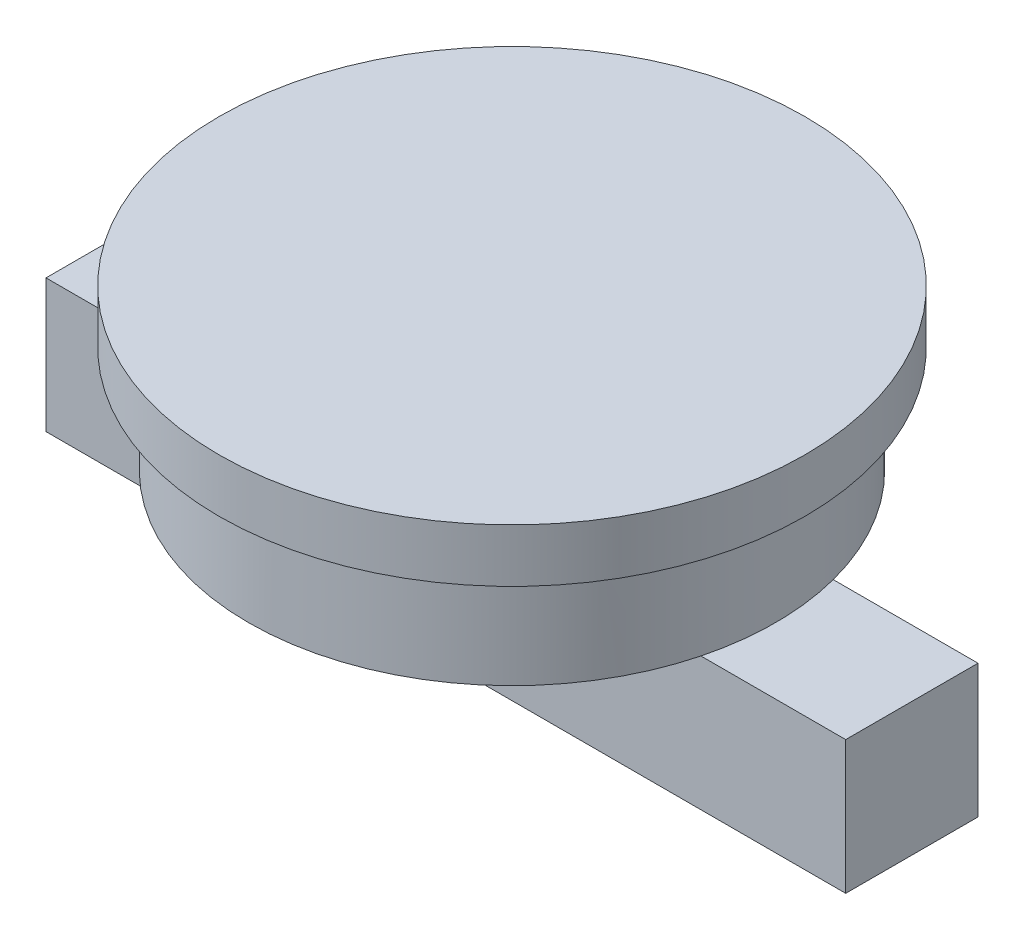
ISO-10303-21;
HEADER;
FILE_DESCRIPTION(('STEP AP214'),'2;1');
FILE_NAME('part.step','',(''),(''),'','','');
FILE_SCHEMA(('AUTOMOTIVE_DESIGN { 1 0 10303 214 1 1 1 1 }'));
ENDSEC;
DATA;
#1=APPLICATION_CONTEXT('core data for automotive mechanical design processes');
#2=APPLICATION_PROTOCOL_DEFINITION('international standard','automotive_design',2000,#1);
#3=PRODUCT_CONTEXT('',#1,'mechanical');
#4=PRODUCT('Part','Part','',(#3));
#5=PRODUCT_RELATED_PRODUCT_CATEGORY('part','',(#4));
#6=PRODUCT_DEFINITION_FORMATION('','',#4);
#7=PRODUCT_DEFINITION_CONTEXT('part definition',#1,'design');
#8=PRODUCT_DEFINITION('design','',#6,#7);
#9=PRODUCT_DEFINITION_SHAPE('','',#8);
#10=(LENGTH_UNIT() NAMED_UNIT(*) SI_UNIT(.MILLI.,.METRE.));
#11=(NAMED_UNIT(*) PLANE_ANGLE_UNIT() SI_UNIT($,.RADIAN.));
#12=(NAMED_UNIT(*) SI_UNIT($,.STERADIAN.) SOLID_ANGLE_UNIT());
#13=UNCERTAINTY_MEASURE_WITH_UNIT(LENGTH_MEASURE(1.E-05),#10,'distance_accuracy_value','');
#14=(GEOMETRIC_REPRESENTATION_CONTEXT(3) GLOBAL_UNCERTAINTY_ASSIGNED_CONTEXT((#13)) GLOBAL_UNIT_ASSIGNED_CONTEXT((#10,
#11,#12)) REPRESENTATION_CONTEXT('',''));
#15=CARTESIAN_POINT('',(0.,0.,0.));
#16=DIRECTION('',(0.,0.,1.));
#17=DIRECTION('',(1.,0.,0.));
#18=AXIS2_PLACEMENT_3D('',#15,#16,#17);
#19=CARTESIAN_POINT('',(0.,-601.,0.));
#20=DIRECTION('',(0.,-1.,0.));
#21=DIRECTION('',(0.,0.,-1.));
#22=AXIS2_PLACEMENT_3D('',#19,#20,#21);
#23=PLANE('',#22);
#24=DIRECTION('',(1.,0.,0.));
#25=VECTOR('',#24,1.);
#26=CARTESIAN_POINT('',(-1501.26503821023,-601.,-248.340104451601));
#27=LINE('',#26,#25);
#28=CARTESIAN_POINT('',(-957.76940448436,-601.,-248.340104451601));
#29=VERTEX_POINT('',#28);
#30=CARTESIAN_POINT('',(957.76940448436,-601.,-248.340104451601));
#31=VERTEX_POINT('',#30);
#32=EDGE_CURVE('E11',#29,#31,#27,.T.);
#33=ORIENTED_EDGE('',*,*,#32,.F.);
#34=CARTESIAN_POINT('',(0.,-601.,0.));
#35=DIRECTION('',(0.,-1.,0.));
#36=DIRECTION('',(0.,0.,-1.));
#37=AXIS2_PLACEMENT_3D('',#34,#35,#36);
#38=CIRCLE('',#37,989.441781837293);
#39=EDGE_CURVE('E126',#29,#31,#38,.T.);
#40=ORIENTED_EDGE('',*,*,#39,.T.);
#41=EDGE_LOOP('',(#33,#40));
#42=FACE_BOUND('',#41,.T.);
#43=ADVANCED_FACE('F43',(#42),#23,.T.);
#44=CARTESIAN_POINT('',(0.,-200.,0.));
#45=DIRECTION('',(0.,1.,0.));
#46=DIRECTION('',(0.,0.,1.));
#47=AXIS2_PLACEMENT_3D('',#44,#45,#46);
#48=CYLINDRICAL_SURFACE('',#47,1100.);
#49=CARTESIAN_POINT('',(0.,-200.,0.));
#50=DIRECTION('',(0.,1.,0.));
#51=DIRECTION('',(0.,0.,1.));
#52=AXIS2_PLACEMENT_3D('',#49,#50,#51);
#53=CIRCLE('',#52,1100.);
#54=CARTESIAN_POINT('',(0.,-200.,1100.));
#55=VERTEX_POINT('',#54);
#56=EDGE_CURVE('E143',#55,#55,#53,.T.);
#57=ORIENTED_EDGE('',*,*,#56,.T.);
#58=EDGE_LOOP('',(#57));
#59=FACE_BOUND('',#58,.T.);
#60=CARTESIAN_POINT('',(0.,0.,0.));
#61=DIRECTION('',(0.,1.,0.));
#62=DIRECTION('',(0.,0.,1.));
#63=AXIS2_PLACEMENT_3D('',#60,#61,#62);
#64=CIRCLE('',#63,1100.);
#65=CARTESIAN_POINT('',(0.,0.,1100.));
#66=VERTEX_POINT('',#65);
#67=EDGE_CURVE('E47',#66,#66,#64,.T.);
#68=ORIENTED_EDGE('',*,*,#67,.F.);
#69=EDGE_LOOP('',(#68));
#70=FACE_BOUND('',#69,.T.);
#71=ADVANCED_FACE('F45',(#59,#70),#48,.T.);
#72=CARTESIAN_POINT('',(0.,-200.,0.));
#73=DIRECTION('',(0.,1.,0.));
#74=DIRECTION('',(0.,0.,1.));
#75=AXIS2_PLACEMENT_3D('',#72,#73,#74);
#76=PLANE('',#75);
#77=CARTESIAN_POINT('',(0.,-200.,0.));
#78=DIRECTION('',(0.,-1.,0.));
#79=DIRECTION('',(0.,0.,-1.));
#80=AXIS2_PLACEMENT_3D('',#77,#78,#79);
#81=CIRCLE('',#80,989.441781837293);
#82=CARTESIAN_POINT('',(0.,-200.,-989.441781837293));
#83=VERTEX_POINT('',#82);
#84=EDGE_CURVE('E140',#83,#83,#81,.T.);
#85=ORIENTED_EDGE('',*,*,#84,.F.);
#86=EDGE_LOOP('',(#85));
#87=FACE_BOUND('',#86,.T.);
#88=ORIENTED_EDGE('',*,*,#56,.F.);
#89=EDGE_LOOP('',(#88));
#90=FACE_BOUND('',#89,.T.);
#91=ADVANCED_FACE('F155',(#87,#90),#76,.F.);
#92=CARTESIAN_POINT('',(0.,0.,0.));
#93=DIRECTION('',(0.,1.,0.));
#94=DIRECTION('',(0.,0.,1.));
#95=AXIS2_PLACEMENT_3D('',#92,#93,#94);
#96=PLANE('',#95);
#97=ORIENTED_EDGE('',*,*,#67,.T.);
#98=EDGE_LOOP('',(#97));
#99=FACE_BOUND('',#98,.T.);
#100=ADVANCED_FACE('F152',(#99),#96,.T.);
#101=CARTESIAN_POINT('',(0.,-601.,0.));
#102=DIRECTION('',(0.,1.,0.));
#103=DIRECTION('',(0.,0.,1.));
#104=AXIS2_PLACEMENT_3D('',#101,#102,#103);
#105=CYLINDRICAL_SURFACE('',#104,989.441781837293);
#106=CARTESIAN_POINT('',(957.76940448436,-601.,248.340104451601));
#107=VERTEX_POINT('',#106);
#108=EDGE_CURVE('E132',#31,#107,#38,.T.);
#109=ORIENTED_EDGE('',*,*,#108,.F.);
#110=ORIENTED_EDGE('',*,*,#39,.F.);
#111=CARTESIAN_POINT('',(-957.76940448436,-601.,248.340104451601));
#112=VERTEX_POINT('',#111);
#113=EDGE_CURVE('E130',#112,#29,#38,.T.);
#114=ORIENTED_EDGE('',*,*,#113,.F.);
#115=EDGE_CURVE('E139',#107,#112,#38,.T.);
#116=ORIENTED_EDGE('',*,*,#115,.F.);
#117=EDGE_LOOP('',(#109,#110,#114,#116));
#118=FACE_BOUND('',#117,.T.);
#119=ORIENTED_EDGE('',*,*,#84,.T.);
#120=EDGE_LOOP('',(#119));
#121=FACE_BOUND('',#120,.T.);
#122=ADVANCED_FACE('F170',(#118,#121),#105,.T.);
#123=DIRECTION('',(-1.,0.,0.));
#124=VECTOR('',#123,1.);
#125=CARTESIAN_POINT('',(-1501.26503821023,-601.,248.340104451601));
#126=LINE('',#125,#124);
#127=EDGE_CURVE('E53',#107,#112,#126,.T.);
#128=ORIENTED_EDGE('',*,*,#127,.F.);
#129=ORIENTED_EDGE('',*,*,#115,.T.);
#130=EDGE_LOOP('',(#128,#129));
#131=FACE_BOUND('',#130,.T.);
#132=ADVANCED_FACE('F163',(#131),#23,.T.);
#133=CARTESIAN_POINT('',(0.,-601.,0.));
#134=DIRECTION('',(0.,1.,0.));
#135=DIRECTION('',(0.,0.,1.));
#136=AXIS2_PLACEMENT_3D('',#133,#134,#135);
#137=PLANE('',#136);
#138=CARTESIAN_POINT('',(1501.26503821023,-601.,-248.340104451601));
#139=VERTEX_POINT('',#138);
#140=EDGE_CURVE('E56',#31,#139,#27,.T.);
#141=ORIENTED_EDGE('',*,*,#140,.F.);
#142=ORIENTED_EDGE('',*,*,#108,.T.);
#143=CARTESIAN_POINT('',(1501.26503821023,-601.,248.340104451601));
#144=VERTEX_POINT('',#143);
#145=EDGE_CURVE('E213',#144,#107,#126,.T.);
#146=ORIENTED_EDGE('',*,*,#145,.F.);
#147=DIRECTION('',(0.,0.,1.));
#148=VECTOR('',#147,1.);
#149=CARTESIAN_POINT('',(1501.26503821023,-601.,-248.340104451601));
#150=LINE('',#149,#148);
#151=EDGE_CURVE('E124',#139,#144,#150,.T.);
#152=ORIENTED_EDGE('',*,*,#151,.F.);
#153=EDGE_LOOP('',(#141,#142,#146,#152));
#154=FACE_BOUND('',#153,.T.);
#155=ADVANCED_FACE('F169',(#154),#137,.T.);
#156=CARTESIAN_POINT('',(1501.26503821023,-1101.,-248.340104451601));
#157=DIRECTION('',(-1.,0.,0.));
#158=DIRECTION('',(0.,0.,1.));
#159=AXIS2_PLACEMENT_3D('',#156,#157,#158);
#160=PLANE('',#159);
#161=ORIENTED_EDGE('',*,*,#151,.T.);
#162=DIRECTION('',(0.,1.,0.));
#163=VECTOR('',#162,1.);
#164=CARTESIAN_POINT('',(1501.26503821023,-1101.,248.340104451601));
#165=LINE('',#164,#163);
#166=CARTESIAN_POINT('',(1501.26503821023,-1101.,248.340104451601));
#167=VERTEX_POINT('',#166);
#168=EDGE_CURVE('E103',#167,#144,#165,.T.);
#169=ORIENTED_EDGE('',*,*,#168,.F.);
#170=DIRECTION('',(0.,0.,1.));
#171=VECTOR('',#170,1.);
#172=CARTESIAN_POINT('',(1501.26503821023,-1101.,-248.340104451601));
#173=LINE('',#172,#171);
#174=CARTESIAN_POINT('',(1501.26503821023,-1101.,-248.340104451601));
#175=VERTEX_POINT('',#174);
#176=EDGE_CURVE('E111',#175,#167,#173,.T.);
#177=ORIENTED_EDGE('',*,*,#176,.F.);
#178=DIRECTION('',(0.,1.,0.));
#179=VECTOR('',#178,1.);
#180=CARTESIAN_POINT('',(1501.26503821023,-1101.,-248.340104451601));
#181=LINE('',#180,#179);
#182=EDGE_CURVE('E203',#175,#139,#181,.T.);
#183=ORIENTED_EDGE('',*,*,#182,.T.);
#184=EDGE_LOOP('',(#161,#169,#177,#183));
#185=FACE_BOUND('',#184,.T.);
#186=ADVANCED_FACE('F122',(#185),#160,.F.);
#187=CARTESIAN_POINT('',(-1501.26503821023,-1101.,248.340104451601));
#188=DIRECTION('',(0.,0.,-1.));
#189=DIRECTION('',(-1.,0.,0.));
#190=AXIS2_PLACEMENT_3D('',#187,#188,#189);
#191=PLANE('',#190);
#192=ORIENTED_EDGE('',*,*,#145,.T.);
#193=ORIENTED_EDGE('',*,*,#127,.T.);
#194=CARTESIAN_POINT('',(-1501.26503821023,-601.,248.340104451601));
#195=VERTEX_POINT('',#194);
#196=EDGE_CURVE('E212',#112,#195,#126,.T.);
#197=ORIENTED_EDGE('',*,*,#196,.T.);
#198=DIRECTION('',(0.,1.,0.));
#199=VECTOR('',#198,1.);
#200=CARTESIAN_POINT('',(-1501.26503821023,-1101.,248.340104451601));
#201=LINE('',#200,#199);
#202=CARTESIAN_POINT('',(-1501.26503821023,-1101.,248.340104451601));
#203=VERTEX_POINT('',#202);
#204=EDGE_CURVE('E106',#203,#195,#201,.T.);
#205=ORIENTED_EDGE('',*,*,#204,.F.);
#206=DIRECTION('',(-1.,0.,0.));
#207=VECTOR('',#206,1.);
#208=CARTESIAN_POINT('',(-1501.26503821023,-1101.,248.340104451601));
#209=LINE('',#208,#207);
#210=EDGE_CURVE('E98',#167,#203,#209,.T.);
#211=ORIENTED_EDGE('',*,*,#210,.F.);
#212=ORIENTED_EDGE('',*,*,#168,.T.);
#213=EDGE_LOOP('',(#192,#193,#197,#205,#211,#212));
#214=FACE_BOUND('',#213,.T.);
#215=ADVANCED_FACE('F101',(#214),#191,.F.);
#216=CARTESIAN_POINT('',(-1501.26503821023,-1101.,-248.340104451601));
#217=DIRECTION('',(1.,0.,0.));
#218=DIRECTION('',(0.,0.,-1.));
#219=AXIS2_PLACEMENT_3D('',#216,#217,#218);
#220=PLANE('',#219);
#221=DIRECTION('',(0.,0.,-1.));
#222=VECTOR('',#221,1.);
#223=CARTESIAN_POINT('',(-1501.26503821023,-601.,-248.340104451601));
#224=LINE('',#223,#222);
#225=CARTESIAN_POINT('',(-1501.26503821023,-601.,-248.340104451601));
#226=VERTEX_POINT('',#225);
#227=EDGE_CURVE('E191',#195,#226,#224,.T.);
#228=ORIENTED_EDGE('',*,*,#227,.T.);
#229=DIRECTION('',(0.,1.,0.));
#230=VECTOR('',#229,1.);
#231=CARTESIAN_POINT('',(-1501.26503821023,-1101.,-248.340104451601));
#232=LINE('',#231,#230);
#233=CARTESIAN_POINT('',(-1501.26503821023,-1101.,-248.340104451601));
#234=VERTEX_POINT('',#233);
#235=EDGE_CURVE('E133',#234,#226,#232,.T.);
#236=ORIENTED_EDGE('',*,*,#235,.F.);
#237=DIRECTION('',(0.,0.,-1.));
#238=VECTOR('',#237,1.);
#239=CARTESIAN_POINT('',(-1501.26503821023,-1101.,-248.340104451601));
#240=LINE('',#239,#238);
#241=EDGE_CURVE('E110',#203,#234,#240,.T.);
#242=ORIENTED_EDGE('',*,*,#241,.F.);
#243=ORIENTED_EDGE('',*,*,#204,.T.);
#244=EDGE_LOOP('',(#228,#236,#242,#243));
#245=FACE_BOUND('',#244,.T.);
#246=ADVANCED_FACE('F220',(#245),#220,.F.);
#247=CARTESIAN_POINT('',(-1501.26503821023,-1101.,-248.340104451601));
#248=DIRECTION('',(0.,0.,1.));
#249=DIRECTION('',(1.,0.,0.));
#250=AXIS2_PLACEMENT_3D('',#247,#248,#249);
#251=PLANE('',#250);
#252=EDGE_CURVE('E55',#226,#29,#27,.T.);
#253=ORIENTED_EDGE('',*,*,#252,.T.);
#254=ORIENTED_EDGE('',*,*,#32,.T.);
#255=ORIENTED_EDGE('',*,*,#140,.T.);
#256=ORIENTED_EDGE('',*,*,#182,.F.);
#257=DIRECTION('',(1.,0.,0.));
#258=VECTOR('',#257,1.);
#259=CARTESIAN_POINT('',(-1501.26503821023,-1101.,-248.340104451601));
#260=LINE('',#259,#258);
#261=EDGE_CURVE('E116',#234,#175,#260,.T.);
#262=ORIENTED_EDGE('',*,*,#261,.F.);
#263=ORIENTED_EDGE('',*,*,#235,.T.);
#264=EDGE_LOOP('',(#253,#254,#255,#256,#262,#263));
#265=FACE_BOUND('',#264,.T.);
#266=ADVANCED_FACE('F193',(#265),#251,.F.);
#267=CARTESIAN_POINT('',(0.,-1101.,0.));
#268=DIRECTION('',(0.,1.,0.));
#269=DIRECTION('',(0.,0.,1.));
#270=AXIS2_PLACEMENT_3D('',#267,#268,#269);
#271=PLANE('',#270);
#272=ORIENTED_EDGE('',*,*,#176,.T.);
#273=ORIENTED_EDGE('',*,*,#210,.T.);
#274=ORIENTED_EDGE('',*,*,#241,.T.);
#275=ORIENTED_EDGE('',*,*,#261,.T.);
#276=EDGE_LOOP('',(#272,#273,#274,#275));
#277=FACE_BOUND('',#276,.T.);
#278=ADVANCED_FACE('F114',(#277),#271,.F.);
#279=ORIENTED_EDGE('',*,*,#196,.F.);
#280=ORIENTED_EDGE('',*,*,#113,.T.);
#281=ORIENTED_EDGE('',*,*,#252,.F.);
#282=ORIENTED_EDGE('',*,*,#227,.F.);
#283=EDGE_LOOP('',(#279,#280,#281,#282));
#284=FACE_BOUND('',#283,.T.);
#285=ADVANCED_FACE('F177',(#284),#137,.T.);
#286=CLOSED_SHELL('',(#43,#71,#91,#100,#122,#132,#155,#186,#215,#246,#266,#278,#285));
#287=MANIFOLD_SOLID_BREP('B2',#286);
#288=ADVANCED_BREP_SHAPE_REPRESENTATION('',(#18,#287),#14);
#289=SHAPE_DEFINITION_REPRESENTATION(#9,#288);
ENDSEC;
END-ISO-10303-21;
